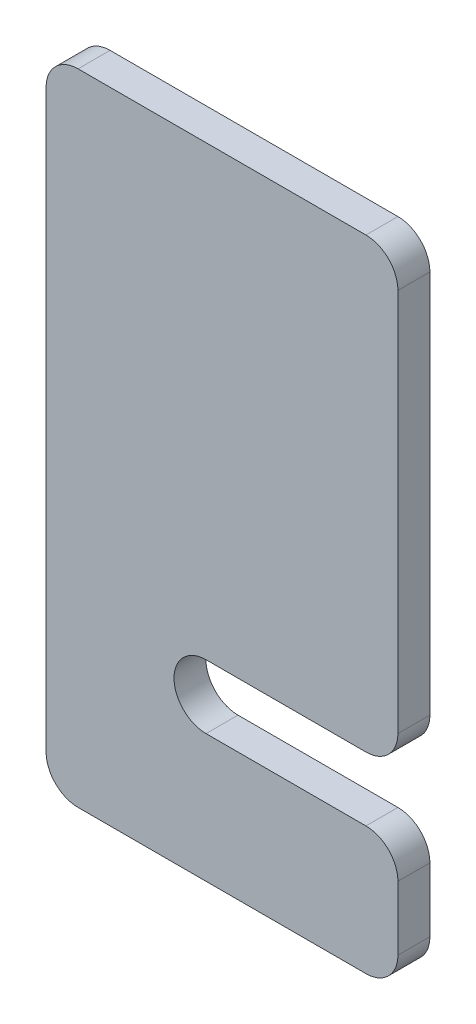
ISO-10303-21;
HEADER;
FILE_DESCRIPTION(('STEP AP214'),'2;1');
FILE_NAME('part.step','',(''),(''),'','','');
FILE_SCHEMA(('AUTOMOTIVE_DESIGN { 1 0 10303 214 1 1 1 1 }'));
ENDSEC;
DATA;
#1=APPLICATION_CONTEXT('core data for automotive mechanical design processes');
#2=APPLICATION_PROTOCOL_DEFINITION('international standard','automotive_design',2000,#1);
#3=PRODUCT_CONTEXT('',#1,'mechanical');
#4=PRODUCT('Part','Part','',(#3));
#5=PRODUCT_RELATED_PRODUCT_CATEGORY('part','',(#4));
#6=PRODUCT_DEFINITION_FORMATION('','',#4);
#7=PRODUCT_DEFINITION_CONTEXT('part definition',#1,'design');
#8=PRODUCT_DEFINITION('design','',#6,#7);
#9=PRODUCT_DEFINITION_SHAPE('','',#8);
#10=(LENGTH_UNIT() NAMED_UNIT(*) SI_UNIT(.MILLI.,.METRE.));
#11=(NAMED_UNIT(*) PLANE_ANGLE_UNIT() SI_UNIT($,.RADIAN.));
#12=(NAMED_UNIT(*) SI_UNIT($,.STERADIAN.) SOLID_ANGLE_UNIT());
#13=UNCERTAINTY_MEASURE_WITH_UNIT(LENGTH_MEASURE(1.E-05),#10,'distance_accuracy_value','');
#14=(GEOMETRIC_REPRESENTATION_CONTEXT(3) GLOBAL_UNCERTAINTY_ASSIGNED_CONTEXT((#13)) GLOBAL_UNIT_ASSIGNED_CONTEXT((#10,
#11,#12)) REPRESENTATION_CONTEXT('',''));
#15=CARTESIAN_POINT('',(0.,0.,0.));
#16=DIRECTION('',(0.,0.,1.));
#17=DIRECTION('',(1.,0.,0.));
#18=AXIS2_PLACEMENT_3D('',#15,#16,#17);
#19=CARTESIAN_POINT('',(50.,15.,5.));
#20=DIRECTION('',(0.,0.,-1.));
#21=DIRECTION('',(-1.,0.,0.));
#22=AXIS2_PLACEMENT_3D('',#19,#20,#21);
#23=CYLINDRICAL_SURFACE('',#22,5.);
#24=CARTESIAN_POINT('',(50.,15.,0.));
#25=DIRECTION('',(0.,0.,1.));
#26=DIRECTION('',(-1.,0.,0.));
#27=AXIS2_PLACEMENT_3D('',#24,#25,#26);
#28=CIRCLE('',#27,5.);
#29=CARTESIAN_POINT('',(55.,15.,0.));
#30=VERTEX_POINT('',#29);
#31=CARTESIAN_POINT('',(50.,20.,0.));
#32=VERTEX_POINT('',#31);
#33=EDGE_CURVE('E165',#30,#32,#28,.T.);
#34=ORIENTED_EDGE('',*,*,#33,.T.);
#35=DIRECTION('',(0.,0.,-1.));
#36=VECTOR('',#35,1.);
#37=CARTESIAN_POINT('',(50.,20.,5.));
#38=LINE('',#37,#36);
#39=CARTESIAN_POINT('',(50.,20.,5.));
#40=VERTEX_POINT('',#39);
#41=EDGE_CURVE('E11',#40,#32,#38,.T.);
#42=ORIENTED_EDGE('',*,*,#41,.F.);
#43=CARTESIAN_POINT('',(50.,15.,5.));
#44=DIRECTION('',(0.,0.,1.));
#45=DIRECTION('',(-1.,0.,0.));
#46=AXIS2_PLACEMENT_3D('',#43,#44,#45);
#47=CIRCLE('',#46,5.);
#48=CARTESIAN_POINT('',(55.,15.,5.));
#49=VERTEX_POINT('',#48);
#50=EDGE_CURVE('E191',#49,#40,#47,.T.);
#51=ORIENTED_EDGE('',*,*,#50,.F.);
#52=DIRECTION('',(0.,0.,-1.));
#53=VECTOR('',#52,1.);
#54=CARTESIAN_POINT('',(55.,15.,5.));
#55=LINE('',#54,#53);
#56=EDGE_CURVE('E161',#49,#30,#55,.T.);
#57=ORIENTED_EDGE('',*,*,#56,.T.);
#58=EDGE_LOOP('',(#34,#42,#51,#57));
#59=FACE_BOUND('',#58,.T.);
#60=ADVANCED_FACE('F33',(#59),#23,.T.);
#61=CARTESIAN_POINT('',(25.,20.,5.));
#62=DIRECTION('',(0.,-1.,0.));
#63=DIRECTION('',(1.,0.,0.));
#64=AXIS2_PLACEMENT_3D('',#61,#62,#63);
#65=PLANE('',#64);
#66=DIRECTION('',(-1.,0.,0.));
#67=VECTOR('',#66,1.);
#68=CARTESIAN_POINT('',(25.,20.,0.));
#69=LINE('',#68,#67);
#70=CARTESIAN_POINT('',(25.,20.,0.));
#71=VERTEX_POINT('',#70);
#72=EDGE_CURVE('E168',#32,#71,#69,.T.);
#73=ORIENTED_EDGE('',*,*,#72,.T.);
#74=DIRECTION('',(0.,0.,-1.));
#75=VECTOR('',#74,1.);
#76=CARTESIAN_POINT('',(25.,20.,5.));
#77=LINE('',#76,#75);
#78=CARTESIAN_POINT('',(25.,20.,5.));
#79=VERTEX_POINT('',#78);
#80=EDGE_CURVE('E41',#79,#71,#77,.T.);
#81=ORIENTED_EDGE('',*,*,#80,.F.);
#82=DIRECTION('',(-1.,0.,0.));
#83=VECTOR('',#82,1.);
#84=CARTESIAN_POINT('',(25.,20.,5.));
#85=LINE('',#84,#83);
#86=EDGE_CURVE('E110',#40,#79,#85,.T.);
#87=ORIENTED_EDGE('',*,*,#86,.F.);
#88=ORIENTED_EDGE('',*,*,#41,.T.);
#89=EDGE_LOOP('',(#73,#81,#87,#88));
#90=FACE_BOUND('',#89,.T.);
#91=ADVANCED_FACE('F279',(#90),#65,.F.);
#92=CARTESIAN_POINT('',(25.,25.,5.));
#93=DIRECTION('',(0.,0.,-1.));
#94=DIRECTION('',(-1.,0.,0.));
#95=AXIS2_PLACEMENT_3D('',#92,#93,#94);
#96=CYLINDRICAL_SURFACE('',#95,5.);
#97=CARTESIAN_POINT('',(25.,25.,0.));
#98=DIRECTION('',(0.,0.,-1.));
#99=DIRECTION('',(1.,0.,0.));
#100=AXIS2_PLACEMENT_3D('',#97,#98,#99);
#101=CIRCLE('',#100,5.);
#102=CARTESIAN_POINT('',(25.,30.,0.));
#103=VERTEX_POINT('',#102);
#104=EDGE_CURVE('E170',#71,#103,#101,.T.);
#105=ORIENTED_EDGE('',*,*,#104,.T.);
#106=DIRECTION('',(0.,0.,-1.));
#107=VECTOR('',#106,1.);
#108=CARTESIAN_POINT('',(25.,30.,5.));
#109=LINE('',#108,#107);
#110=CARTESIAN_POINT('',(25.,30.,5.));
#111=VERTEX_POINT('',#110);
#112=EDGE_CURVE('E216',#111,#103,#109,.T.);
#113=ORIENTED_EDGE('',*,*,#112,.F.);
#114=CARTESIAN_POINT('',(25.,25.,5.));
#115=DIRECTION('',(0.,0.,-1.));
#116=DIRECTION('',(1.,0.,0.));
#117=AXIS2_PLACEMENT_3D('',#114,#115,#116);
#118=CIRCLE('',#117,5.);
#119=EDGE_CURVE('E224',#79,#111,#118,.T.);
#120=ORIENTED_EDGE('',*,*,#119,.F.);
#121=ORIENTED_EDGE('',*,*,#80,.T.);
#122=EDGE_LOOP('',(#105,#113,#120,#121));
#123=FACE_BOUND('',#122,.T.);
#124=ADVANCED_FACE('F222',(#123),#96,.F.);
#125=CARTESIAN_POINT('',(50.,30.,5.));
#126=DIRECTION('',(0.,1.,0.));
#127=DIRECTION('',(-1.,0.,0.));
#128=AXIS2_PLACEMENT_3D('',#125,#126,#127);
#129=PLANE('',#128);
#130=DIRECTION('',(1.,0.,0.));
#131=VECTOR('',#130,1.);
#132=CARTESIAN_POINT('',(50.,30.,0.));
#133=LINE('',#132,#131);
#134=CARTESIAN_POINT('',(50.,30.,0.));
#135=VERTEX_POINT('',#134);
#136=EDGE_CURVE('E172',#103,#135,#133,.T.);
#137=ORIENTED_EDGE('',*,*,#136,.T.);
#138=DIRECTION('',(0.,0.,-1.));
#139=VECTOR('',#138,1.);
#140=CARTESIAN_POINT('',(50.,30.,5.));
#141=LINE('',#140,#139);
#142=CARTESIAN_POINT('',(50.,30.,5.));
#143=VERTEX_POINT('',#142);
#144=EDGE_CURVE('E213',#143,#135,#141,.T.);
#145=ORIENTED_EDGE('',*,*,#144,.F.);
#146=DIRECTION('',(1.,0.,0.));
#147=VECTOR('',#146,1.);
#148=CARTESIAN_POINT('',(50.,30.,5.));
#149=LINE('',#148,#147);
#150=EDGE_CURVE('E242',#111,#143,#149,.T.);
#151=ORIENTED_EDGE('',*,*,#150,.F.);
#152=ORIENTED_EDGE('',*,*,#112,.T.);
#153=EDGE_LOOP('',(#137,#145,#151,#152));
#154=FACE_BOUND('',#153,.T.);
#155=ADVANCED_FACE('F233',(#154),#129,.F.);
#156=CARTESIAN_POINT('',(50.,35.,5.));
#157=DIRECTION('',(0.,0.,-1.));
#158=DIRECTION('',(-1.,0.,0.));
#159=AXIS2_PLACEMENT_3D('',#156,#157,#158);
#160=CYLINDRICAL_SURFACE('',#159,5.);
#161=CARTESIAN_POINT('',(50.,35.,0.));
#162=DIRECTION('',(0.,0.,1.));
#163=DIRECTION('',(1.,0.,0.));
#164=AXIS2_PLACEMENT_3D('',#161,#162,#163);
#165=CIRCLE('',#164,5.);
#166=CARTESIAN_POINT('',(55.,35.,0.));
#167=VERTEX_POINT('',#166);
#168=EDGE_CURVE('E174',#135,#167,#165,.T.);
#169=ORIENTED_EDGE('',*,*,#168,.T.);
#170=DIRECTION('',(0.,0.,-1.));
#171=VECTOR('',#170,1.);
#172=CARTESIAN_POINT('',(55.,35.,5.));
#173=LINE('',#172,#171);
#174=CARTESIAN_POINT('',(55.,35.,5.));
#175=VERTEX_POINT('',#174);
#176=EDGE_CURVE('E210',#175,#167,#173,.T.);
#177=ORIENTED_EDGE('',*,*,#176,.F.);
#178=CARTESIAN_POINT('',(50.,35.,5.));
#179=DIRECTION('',(0.,0.,1.));
#180=DIRECTION('',(1.,0.,0.));
#181=AXIS2_PLACEMENT_3D('',#178,#179,#180);
#182=CIRCLE('',#181,5.);
#183=EDGE_CURVE('E239',#143,#175,#182,.T.);
#184=ORIENTED_EDGE('',*,*,#183,.F.);
#185=ORIENTED_EDGE('',*,*,#144,.T.);
#186=EDGE_LOOP('',(#169,#177,#184,#185));
#187=FACE_BOUND('',#186,.T.);
#188=ADVANCED_FACE('F237',(#187),#160,.T.);
#189=CARTESIAN_POINT('',(55.,95.,5.));
#190=DIRECTION('',(-1.,0.,0.));
#191=DIRECTION('',(0.,-1.,0.));
#192=AXIS2_PLACEMENT_3D('',#189,#190,#191);
#193=PLANE('',#192);
#194=DIRECTION('',(0.,1.,0.));
#195=VECTOR('',#194,1.);
#196=CARTESIAN_POINT('',(55.,95.,0.));
#197=LINE('',#196,#195);
#198=CARTESIAN_POINT('',(55.,95.,0.));
#199=VERTEX_POINT('',#198);
#200=EDGE_CURVE('E176',#167,#199,#197,.T.);
#201=ORIENTED_EDGE('',*,*,#200,.T.);
#202=DIRECTION('',(0.,0.,-1.));
#203=VECTOR('',#202,1.);
#204=CARTESIAN_POINT('',(55.,95.,5.));
#205=LINE('',#204,#203);
#206=CARTESIAN_POINT('',(55.,95.,5.));
#207=VERTEX_POINT('',#206);
#208=EDGE_CURVE('E207',#207,#199,#205,.T.);
#209=ORIENTED_EDGE('',*,*,#208,.F.);
#210=DIRECTION('',(0.,1.,0.));
#211=VECTOR('',#210,1.);
#212=CARTESIAN_POINT('',(55.,95.,5.));
#213=LINE('',#212,#211);
#214=EDGE_CURVE('E241',#175,#207,#213,.T.);
#215=ORIENTED_EDGE('',*,*,#214,.F.);
#216=ORIENTED_EDGE('',*,*,#176,.T.);
#217=EDGE_LOOP('',(#201,#209,#215,#216));
#218=FACE_BOUND('',#217,.T.);
#219=ADVANCED_FACE('F292',(#218),#193,.F.);
#220=CARTESIAN_POINT('',(50.,95.,5.));
#221=DIRECTION('',(0.,0.,-1.));
#222=DIRECTION('',(-1.,0.,0.));
#223=AXIS2_PLACEMENT_3D('',#220,#221,#222);
#224=CYLINDRICAL_SURFACE('',#223,5.);
#225=CARTESIAN_POINT('',(50.,95.,0.));
#226=DIRECTION('',(0.,0.,1.));
#227=DIRECTION('',(-1.,0.,0.));
#228=AXIS2_PLACEMENT_3D('',#225,#226,#227);
#229=CIRCLE('',#228,5.);
#230=CARTESIAN_POINT('',(50.,100.,0.));
#231=VERTEX_POINT('',#230);
#232=EDGE_CURVE('E178',#199,#231,#229,.T.);
#233=ORIENTED_EDGE('',*,*,#232,.T.);
#234=DIRECTION('',(0.,0.,-1.));
#235=VECTOR('',#234,1.);
#236=CARTESIAN_POINT('',(50.,100.,5.));
#237=LINE('',#236,#235);
#238=CARTESIAN_POINT('',(50.,100.,5.));
#239=VERTEX_POINT('',#238);
#240=EDGE_CURVE('E204',#239,#231,#237,.T.);
#241=ORIENTED_EDGE('',*,*,#240,.F.);
#242=CARTESIAN_POINT('',(50.,95.,5.));
#243=DIRECTION('',(0.,0.,1.));
#244=DIRECTION('',(-1.,0.,0.));
#245=AXIS2_PLACEMENT_3D('',#242,#243,#244);
#246=CIRCLE('',#245,5.);
#247=EDGE_CURVE('E244',#207,#239,#246,.T.);
#248=ORIENTED_EDGE('',*,*,#247,.F.);
#249=ORIENTED_EDGE('',*,*,#208,.T.);
#250=EDGE_LOOP('',(#233,#241,#248,#249));
#251=FACE_BOUND('',#250,.T.);
#252=ADVANCED_FACE('F295',(#251),#224,.T.);
#253=CARTESIAN_POINT('',(5.,100.,5.));
#254=DIRECTION('',(0.,-1.,0.));
#255=DIRECTION('',(0.,0.,-1.));
#256=AXIS2_PLACEMENT_3D('',#253,#254,#255);
#257=PLANE('',#256);
#258=DIRECTION('',(-1.,0.,0.));
#259=VECTOR('',#258,1.);
#260=CARTESIAN_POINT('',(5.,100.,0.));
#261=LINE('',#260,#259);
#262=CARTESIAN_POINT('',(5.,100.,0.));
#263=VERTEX_POINT('',#262);
#264=EDGE_CURVE('E180',#231,#263,#261,.T.);
#265=ORIENTED_EDGE('',*,*,#264,.T.);
#266=DIRECTION('',(0.,0.,-1.));
#267=VECTOR('',#266,1.);
#268=CARTESIAN_POINT('',(5.,100.,5.));
#269=LINE('',#268,#267);
#270=CARTESIAN_POINT('',(5.,100.,5.));
#271=VERTEX_POINT('',#270);
#272=EDGE_CURVE('E201',#271,#263,#269,.T.);
#273=ORIENTED_EDGE('',*,*,#272,.F.);
#274=DIRECTION('',(-1.,0.,0.));
#275=VECTOR('',#274,1.);
#276=CARTESIAN_POINT('',(5.,100.,5.));
#277=LINE('',#276,#275);
#278=EDGE_CURVE('E250',#239,#271,#277,.T.);
#279=ORIENTED_EDGE('',*,*,#278,.F.);
#280=ORIENTED_EDGE('',*,*,#240,.T.);
#281=EDGE_LOOP('',(#265,#273,#279,#280));
#282=FACE_BOUND('',#281,.T.);
#283=ADVANCED_FACE('F299',(#282),#257,.F.);
#284=CARTESIAN_POINT('',(5.,95.,5.));
#285=DIRECTION('',(0.,0.,-1.));
#286=DIRECTION('',(-1.,0.,0.));
#287=AXIS2_PLACEMENT_3D('',#284,#285,#286);
#288=CYLINDRICAL_SURFACE('',#287,5.);
#289=CARTESIAN_POINT('',(5.,95.,0.));
#290=DIRECTION('',(0.,0.,1.));
#291=DIRECTION('',(-1.,0.,0.));
#292=AXIS2_PLACEMENT_3D('',#289,#290,#291);
#293=CIRCLE('',#292,5.);
#294=CARTESIAN_POINT('',(0.,95.,0.));
#295=VERTEX_POINT('',#294);
#296=EDGE_CURVE('E182',#263,#295,#293,.T.);
#297=ORIENTED_EDGE('',*,*,#296,.T.);
#298=DIRECTION('',(0.,0.,-1.));
#299=VECTOR('',#298,1.);
#300=CARTESIAN_POINT('',(0.,95.,5.));
#301=LINE('',#300,#299);
#302=CARTESIAN_POINT('',(0.,95.,5.));
#303=VERTEX_POINT('',#302);
#304=EDGE_CURVE('E198',#303,#295,#301,.T.);
#305=ORIENTED_EDGE('',*,*,#304,.F.);
#306=CARTESIAN_POINT('',(5.,95.,5.));
#307=DIRECTION('',(0.,0.,1.));
#308=DIRECTION('',(-1.,0.,0.));
#309=AXIS2_PLACEMENT_3D('',#306,#307,#308);
#310=CIRCLE('',#309,5.);
#311=EDGE_CURVE('E252',#271,#303,#310,.T.);
#312=ORIENTED_EDGE('',*,*,#311,.F.);
#313=ORIENTED_EDGE('',*,*,#272,.T.);
#314=EDGE_LOOP('',(#297,#305,#312,#313));
#315=FACE_BOUND('',#314,.T.);
#316=ADVANCED_FACE('F303',(#315),#288,.T.);
#317=CARTESIAN_POINT('',(0.,5.00000000000004,5.));
#318=DIRECTION('',(1.,0.,0.));
#319=DIRECTION('',(0.,0.,-1.));
#320=AXIS2_PLACEMENT_3D('',#317,#318,#319);
#321=PLANE('',#320);
#322=DIRECTION('',(0.,-1.,0.));
#323=VECTOR('',#322,1.);
#324=CARTESIAN_POINT('',(0.,5.00000000000004,0.));
#325=LINE('',#324,#323);
#326=CARTESIAN_POINT('',(0.,5.00000000000004,0.));
#327=VERTEX_POINT('',#326);
#328=EDGE_CURVE('E184',#295,#327,#325,.T.);
#329=ORIENTED_EDGE('',*,*,#328,.T.);
#330=DIRECTION('',(0.,0.,-1.));
#331=VECTOR('',#330,1.);
#332=CARTESIAN_POINT('',(0.,5.00000000000004,5.));
#333=LINE('',#332,#331);
#334=CARTESIAN_POINT('',(0.,5.00000000000004,5.));
#335=VERTEX_POINT('',#334);
#336=EDGE_CURVE('E195',#335,#327,#333,.T.);
#337=ORIENTED_EDGE('',*,*,#336,.F.);
#338=DIRECTION('',(0.,-1.,0.));
#339=VECTOR('',#338,1.);
#340=CARTESIAN_POINT('',(0.,5.00000000000004,5.));
#341=LINE('',#340,#339);
#342=EDGE_CURVE('E254',#303,#335,#341,.T.);
#343=ORIENTED_EDGE('',*,*,#342,.F.);
#344=ORIENTED_EDGE('',*,*,#304,.T.);
#345=EDGE_LOOP('',(#329,#337,#343,#344));
#346=FACE_BOUND('',#345,.T.);
#347=ADVANCED_FACE('F260',(#346),#321,.F.);
#348=CARTESIAN_POINT('',(5.,5.,5.));
#349=DIRECTION('',(0.,0.,-1.));
#350=DIRECTION('',(-1.,0.,0.));
#351=AXIS2_PLACEMENT_3D('',#348,#349,#350);
#352=CYLINDRICAL_SURFACE('',#351,5.);
#353=CARTESIAN_POINT('',(5.,5.,0.));
#354=DIRECTION('',(0.,0.,1.));
#355=DIRECTION('',(-1.,0.,0.));
#356=AXIS2_PLACEMENT_3D('',#353,#354,#355);
#357=CIRCLE('',#356,5.);
#358=CARTESIAN_POINT('',(5.00000000000004,0.,0.));
#359=VERTEX_POINT('',#358);
#360=EDGE_CURVE('E186',#327,#359,#357,.T.);
#361=ORIENTED_EDGE('',*,*,#360,.T.);
#362=DIRECTION('',(0.,0.,-1.));
#363=VECTOR('',#362,1.);
#364=CARTESIAN_POINT('',(5.00000000000004,0.,5.));
#365=LINE('',#364,#363);
#366=CARTESIAN_POINT('',(5.00000000000004,0.,5.));
#367=VERTEX_POINT('',#366);
#368=EDGE_CURVE('E156',#367,#359,#365,.T.);
#369=ORIENTED_EDGE('',*,*,#368,.F.);
#370=CARTESIAN_POINT('',(5.,5.,5.));
#371=DIRECTION('',(0.,0.,1.));
#372=DIRECTION('',(-1.,0.,0.));
#373=AXIS2_PLACEMENT_3D('',#370,#371,#372);
#374=CIRCLE('',#373,5.);
#375=EDGE_CURVE('E147',#335,#367,#374,.T.);
#376=ORIENTED_EDGE('',*,*,#375,.F.);
#377=ORIENTED_EDGE('',*,*,#336,.T.);
#378=EDGE_LOOP('',(#361,#369,#376,#377));
#379=FACE_BOUND('',#378,.T.);
#380=ADVANCED_FACE('F264',(#379),#352,.T.);
#381=CARTESIAN_POINT('',(5.00000000000004,0.,5.));
#382=DIRECTION('',(0.,1.,0.));
#383=DIRECTION('',(0.,0.,1.));
#384=AXIS2_PLACEMENT_3D('',#381,#382,#383);
#385=PLANE('',#384);
#386=DIRECTION('',(1.,0.,0.));
#387=VECTOR('',#386,1.);
#388=CARTESIAN_POINT('',(5.00000000000004,0.,0.));
#389=LINE('',#388,#387);
#390=CARTESIAN_POINT('',(50.,0.,0.));
#391=VERTEX_POINT('',#390);
#392=EDGE_CURVE('E155',#359,#391,#389,.T.);
#393=ORIENTED_EDGE('',*,*,#392,.T.);
#394=DIRECTION('',(0.,0.,-1.));
#395=VECTOR('',#394,1.);
#396=CARTESIAN_POINT('',(50.,0.,5.));
#397=LINE('',#396,#395);
#398=CARTESIAN_POINT('',(50.,0.,5.));
#399=VERTEX_POINT('',#398);
#400=EDGE_CURVE('E152',#399,#391,#397,.T.);
#401=ORIENTED_EDGE('',*,*,#400,.F.);
#402=DIRECTION('',(1.,0.,0.));
#403=VECTOR('',#402,1.);
#404=CARTESIAN_POINT('',(5.00000000000004,0.,5.));
#405=LINE('',#404,#403);
#406=EDGE_CURVE('E141',#367,#399,#405,.T.);
#407=ORIENTED_EDGE('',*,*,#406,.F.);
#408=ORIENTED_EDGE('',*,*,#368,.T.);
#409=EDGE_LOOP('',(#393,#401,#407,#408));
#410=FACE_BOUND('',#409,.T.);
#411=ADVANCED_FACE('F153',(#410),#385,.F.);
#412=CARTESIAN_POINT('',(50.,5.,5.));
#413=DIRECTION('',(0.,0.,-1.));
#414=DIRECTION('',(-1.,0.,0.));
#415=AXIS2_PLACEMENT_3D('',#412,#413,#414);
#416=CYLINDRICAL_SURFACE('',#415,5.);
#417=CARTESIAN_POINT('',(50.,5.,0.));
#418=DIRECTION('',(0.,0.,1.));
#419=DIRECTION('',(-1.,0.,0.));
#420=AXIS2_PLACEMENT_3D('',#417,#418,#419);
#421=CIRCLE('',#420,5.);
#422=CARTESIAN_POINT('',(55.,5.,0.));
#423=VERTEX_POINT('',#422);
#424=EDGE_CURVE('E96',#391,#423,#421,.T.);
#425=ORIENTED_EDGE('',*,*,#424,.T.);
#426=DIRECTION('',(0.,0.,-1.));
#427=VECTOR('',#426,1.);
#428=CARTESIAN_POINT('',(55.,5.,5.));
#429=LINE('',#428,#427);
#430=CARTESIAN_POINT('',(55.,5.,5.));
#431=VERTEX_POINT('',#430);
#432=EDGE_CURVE('E157',#431,#423,#429,.T.);
#433=ORIENTED_EDGE('',*,*,#432,.F.);
#434=CARTESIAN_POINT('',(50.,5.,5.));
#435=DIRECTION('',(0.,0.,1.));
#436=DIRECTION('',(-1.,0.,0.));
#437=AXIS2_PLACEMENT_3D('',#434,#435,#436);
#438=CIRCLE('',#437,5.);
#439=EDGE_CURVE('E145',#399,#431,#438,.T.);
#440=ORIENTED_EDGE('',*,*,#439,.F.);
#441=ORIENTED_EDGE('',*,*,#400,.T.);
#442=EDGE_LOOP('',(#425,#433,#440,#441));
#443=FACE_BOUND('',#442,.T.);
#444=ADVANCED_FACE('F159',(#443),#416,.T.);
#445=CARTESIAN_POINT('',(55.,15.,5.));
#446=DIRECTION('',(-1.,0.,0.));
#447=DIRECTION('',(0.,-1.,0.));
#448=AXIS2_PLACEMENT_3D('',#445,#446,#447);
#449=PLANE('',#448);
#450=DIRECTION('',(0.,1.,0.));
#451=VECTOR('',#450,1.);
#452=CARTESIAN_POINT('',(55.,15.,0.));
#453=LINE('',#452,#451);
#454=EDGE_CURVE('E102',#423,#30,#453,.T.);
#455=ORIENTED_EDGE('',*,*,#454,.T.);
#456=ORIENTED_EDGE('',*,*,#56,.F.);
#457=DIRECTION('',(0.,1.,0.));
#458=VECTOR('',#457,1.);
#459=CARTESIAN_POINT('',(55.,15.,5.));
#460=LINE('',#459,#458);
#461=EDGE_CURVE('E49',#431,#49,#460,.T.);
#462=ORIENTED_EDGE('',*,*,#461,.F.);
#463=ORIENTED_EDGE('',*,*,#432,.T.);
#464=EDGE_LOOP('',(#455,#456,#462,#463));
#465=FACE_BOUND('',#464,.T.);
#466=ADVANCED_FACE('F268',(#465),#449,.F.);
#467=CARTESIAN_POINT('',(50.,15.,5.));
#468=DIRECTION('',(0.,0.,-1.));
#469=DIRECTION('',(-1.,0.,0.));
#470=AXIS2_PLACEMENT_3D('',#467,#468,#469);
#471=PLANE('',#470);
#472=ORIENTED_EDGE('',*,*,#50,.T.);
#473=ORIENTED_EDGE('',*,*,#86,.T.);
#474=ORIENTED_EDGE('',*,*,#119,.T.);
#475=ORIENTED_EDGE('',*,*,#150,.T.);
#476=ORIENTED_EDGE('',*,*,#183,.T.);
#477=ORIENTED_EDGE('',*,*,#214,.T.);
#478=ORIENTED_EDGE('',*,*,#247,.T.);
#479=ORIENTED_EDGE('',*,*,#278,.T.);
#480=ORIENTED_EDGE('',*,*,#311,.T.);
#481=ORIENTED_EDGE('',*,*,#342,.T.);
#482=ORIENTED_EDGE('',*,*,#375,.T.);
#483=ORIENTED_EDGE('',*,*,#406,.T.);
#484=ORIENTED_EDGE('',*,*,#439,.T.);
#485=ORIENTED_EDGE('',*,*,#461,.T.);
#486=EDGE_LOOP('',(#472,#473,#474,#475,#476,#477,#478,#479,#480,#481,#482,#483,#484,#485));
#487=FACE_BOUND('',#486,.T.);
#488=ADVANCED_FACE('F143',(#487),#471,.F.);
#489=CARTESIAN_POINT('',(50.,15.,0.));
#490=DIRECTION('',(0.,0.,-1.));
#491=DIRECTION('',(-1.,0.,0.));
#492=AXIS2_PLACEMENT_3D('',#489,#490,#491);
#493=PLANE('',#492);
#494=ORIENTED_EDGE('',*,*,#33,.F.);
#495=ORIENTED_EDGE('',*,*,#454,.F.);
#496=ORIENTED_EDGE('',*,*,#424,.F.);
#497=ORIENTED_EDGE('',*,*,#392,.F.);
#498=ORIENTED_EDGE('',*,*,#360,.F.);
#499=ORIENTED_EDGE('',*,*,#328,.F.);
#500=ORIENTED_EDGE('',*,*,#296,.F.);
#501=ORIENTED_EDGE('',*,*,#264,.F.);
#502=ORIENTED_EDGE('',*,*,#232,.F.);
#503=ORIENTED_EDGE('',*,*,#200,.F.);
#504=ORIENTED_EDGE('',*,*,#168,.F.);
#505=ORIENTED_EDGE('',*,*,#136,.F.);
#506=ORIENTED_EDGE('',*,*,#104,.F.);
#507=ORIENTED_EDGE('',*,*,#72,.F.);
#508=EDGE_LOOP('',(#494,#495,#496,#497,#498,#499,#500,#501,#502,#503,#504,#505,#506,#507));
#509=FACE_BOUND('',#508,.T.);
#510=ADVANCED_FACE('F228',(#509),#493,.T.);
#511=CLOSED_SHELL('',(#60,#91,#124,#155,#188,#219,#252,#283,#316,#347,#380,#411,#444,#466,#488,#510));
#512=MANIFOLD_SOLID_BREP('B2',#511);
#513=ADVANCED_BREP_SHAPE_REPRESENTATION('',(#18,#512),#14);
#514=SHAPE_DEFINITION_REPRESENTATION(#9,#513);
ENDSEC;
END-ISO-10303-21;
